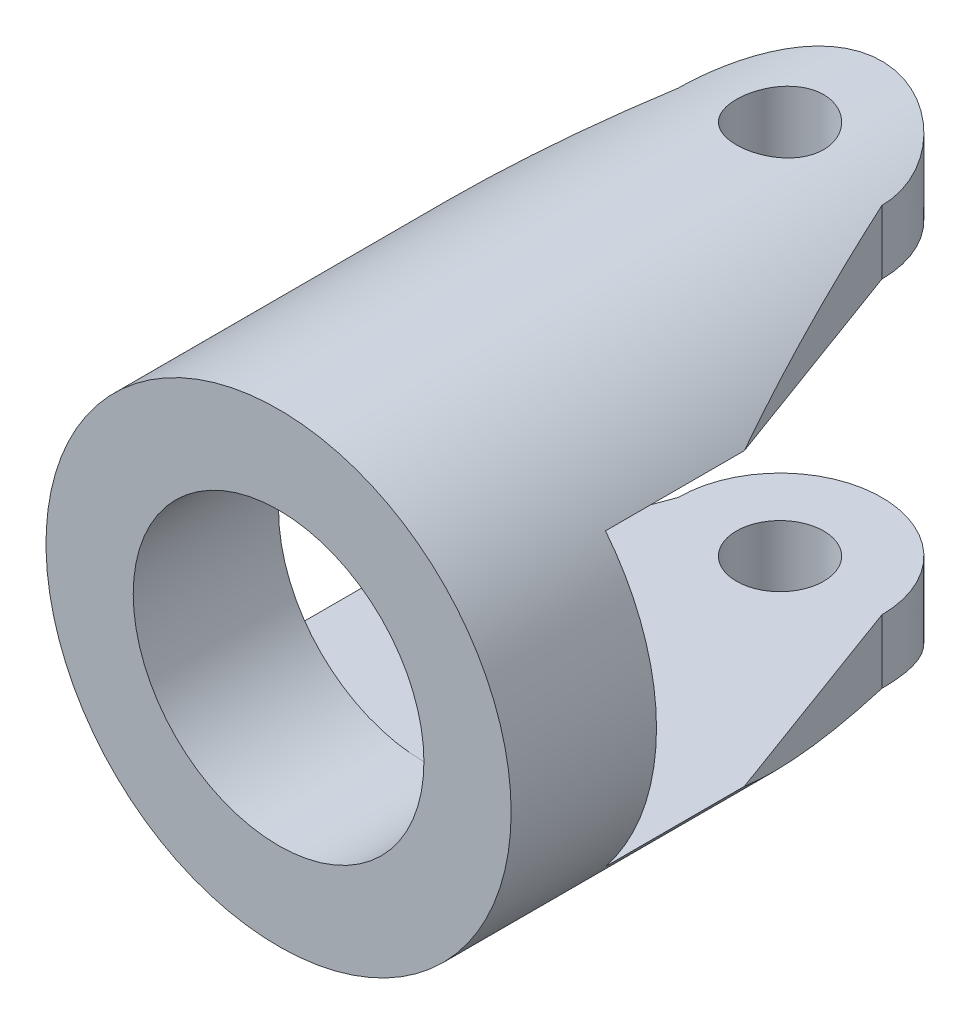
ISO-10303-21;
HEADER;
FILE_DESCRIPTION(('STEP AP214'),'2;1');
FILE_NAME('part.step','',(''),(''),'','','');
FILE_SCHEMA(('AUTOMOTIVE_DESIGN { 1 0 10303 214 1 1 1 1 }'));
ENDSEC;
DATA;
#1=APPLICATION_CONTEXT('core data for automotive mechanical design processes');
#2=APPLICATION_PROTOCOL_DEFINITION('international standard','automotive_design',2000,#1);
#3=PRODUCT_CONTEXT('',#1,'mechanical');
#4=PRODUCT('Part','Part','',(#3));
#5=PRODUCT_RELATED_PRODUCT_CATEGORY('part','',(#4));
#6=PRODUCT_DEFINITION_FORMATION('','',#4);
#7=PRODUCT_DEFINITION_CONTEXT('part definition',#1,'design');
#8=PRODUCT_DEFINITION('design','',#6,#7);
#9=PRODUCT_DEFINITION_SHAPE('','',#8);
#10=(LENGTH_UNIT() NAMED_UNIT(*) SI_UNIT(.MILLI.,.METRE.));
#11=(NAMED_UNIT(*) PLANE_ANGLE_UNIT() SI_UNIT($,.RADIAN.));
#12=(NAMED_UNIT(*) SI_UNIT($,.STERADIAN.) SOLID_ANGLE_UNIT());
#13=UNCERTAINTY_MEASURE_WITH_UNIT(LENGTH_MEASURE(1.E-05),#10,'distance_accuracy_value','');
#14=(GEOMETRIC_REPRESENTATION_CONTEXT(3) GLOBAL_UNCERTAINTY_ASSIGNED_CONTEXT((#13)) GLOBAL_UNIT_ASSIGNED_CONTEXT((#10,
#11,#12)) REPRESENTATION_CONTEXT('',''));
#15=CARTESIAN_POINT('',(0.,0.,0.));
#16=DIRECTION('',(0.,0.,1.));
#17=DIRECTION('',(1.,0.,0.));
#18=AXIS2_PLACEMENT_3D('',#15,#16,#17);
#19=CARTESIAN_POINT('',(-8.,-8.,15.75));
#20=DIRECTION('',(0.938669759516728,0.,0.344817462679614));
#21=DIRECTION('',(0.344817462679614,0.,-0.938669759516728));
#22=AXIS2_PLACEMENT_3D('',#19,#20,#21);
#23=PLANE('',#22);
#24=CARTESIAN_POINT('',(0.,0.,-6.02777777777778));
#25=DIRECTION('',(0.938669759516728,0.,0.344817462679614));
#26=DIRECTION('',(0.344817462679614,0.,-0.938669759516728));
#27=AXIS2_PLACEMENT_3D('',#24,#25,#26);
#28=ELLIPSE('',#27,23.2006811309123,8.);
#29=CARTESIAN_POINT('',(-6.24499799839839,-5.,10.9724945511956));
#30=VERTEX_POINT('',#29);
#31=CARTESIAN_POINT('',(-3.5,-7.19374728496908,3.5));
#32=VERTEX_POINT('',#31);
#33=EDGE_CURVE('E198',#30,#32,#28,.T.);
#34=ORIENTED_EDGE('',*,*,#33,.F.);
#35=DIRECTION('',(0.344817462679614,0.,-0.938669759516728));
#36=VECTOR('',#35,1.);
#37=CARTESIAN_POINT('',(-8.,-5.,15.75));
#38=LINE('',#37,#36);
#39=CARTESIAN_POINT('',(-3.5,-5.,3.5));
#40=VERTEX_POINT('',#39);
#41=EDGE_CURVE('E136',#30,#40,#38,.T.);
#42=ORIENTED_EDGE('',*,*,#41,.T.);
#43=DIRECTION('',(0.,1.,0.));
#44=VECTOR('',#43,1.);
#45=CARTESIAN_POINT('',(-3.5,-8.,3.5));
#46=LINE('',#45,#44);
#47=EDGE_CURVE('E190',#32,#40,#46,.T.);
#48=ORIENTED_EDGE('',*,*,#47,.F.);
#49=EDGE_LOOP('',(#34,#42,#48));
#50=FACE_BOUND('',#49,.T.);
#51=ADVANCED_FACE('F45',(#50),#23,.F.);
#52=CARTESIAN_POINT('',(3.5,-8.,3.5));
#53=DIRECTION('',(-0.938669759516728,0.,0.344817462679614));
#54=DIRECTION('',(0.344817462679614,0.,0.938669759516728));
#55=AXIS2_PLACEMENT_3D('',#52,#53,#54);
#56=PLANE('',#55);
#57=DIRECTION('',(0.,1.,0.));
#58=VECTOR('',#57,1.);
#59=CARTESIAN_POINT('',(3.5,-8.,3.5));
#60=LINE('',#59,#58);
#61=CARTESIAN_POINT('',(3.5,-7.19374728496908,3.5));
#62=VERTEX_POINT('',#61);
#63=CARTESIAN_POINT('',(3.5,-5.,3.5));
#64=VERTEX_POINT('',#63);
#65=EDGE_CURVE('E191',#62,#64,#60,.T.);
#66=ORIENTED_EDGE('',*,*,#65,.T.);
#67=DIRECTION('',(0.344817462679614,0.,0.938669759516728));
#68=VECTOR('',#67,1.);
#69=CARTESIAN_POINT('',(3.5,-5.,3.5));
#70=LINE('',#69,#68);
#71=CARTESIAN_POINT('',(6.2449979983984,-5.,10.9724945511956));
#72=VERTEX_POINT('',#71);
#73=EDGE_CURVE('E138',#64,#72,#70,.T.);
#74=ORIENTED_EDGE('',*,*,#73,.T.);
#75=CARTESIAN_POINT('',(0.,0.,-6.02777777777778));
#76=DIRECTION('',(-0.938669759516728,0.,0.344817462679614));
#77=DIRECTION('',(-0.344817462679614,0.,-0.938669759516728));
#78=AXIS2_PLACEMENT_3D('',#75,#76,#77);
#79=ELLIPSE('',#78,23.2006811309123,8.);
#80=EDGE_CURVE('E195',#62,#72,#79,.T.);
#81=ORIENTED_EDGE('',*,*,#80,.F.);
#82=EDGE_LOOP('',(#66,#74,#81));
#83=FACE_BOUND('',#82,.T.);
#84=ADVANCED_FACE('F233',(#83),#56,.F.);
#85=CARTESIAN_POINT('',(0.,0.,20.75));
#86=DIRECTION('',(0.,0.,1.));
#87=DIRECTION('',(1.,0.,0.));
#88=AXIS2_PLACEMENT_3D('',#85,#86,#87);
#89=PLANE('',#88);
#90=CARTESIAN_POINT('',(0.,0.,20.75));
#91=DIRECTION('',(0.,0.,1.));
#92=DIRECTION('',(1.,0.,0.));
#93=AXIS2_PLACEMENT_3D('',#90,#91,#92);
#94=CIRCLE('',#93,8.);
#95=CARTESIAN_POINT('',(8.,0.,20.75));
#96=VERTEX_POINT('',#95);
#97=EDGE_CURVE('E289',#96,#96,#94,.T.);
#98=ORIENTED_EDGE('',*,*,#97,.T.);
#99=EDGE_LOOP('',(#98));
#100=FACE_BOUND('',#99,.T.);
#101=CARTESIAN_POINT('',(0.,0.,20.75));
#102=DIRECTION('',(0.,0.,1.));
#103=DIRECTION('',(1.,0.,0.));
#104=AXIS2_PLACEMENT_3D('',#101,#102,#103);
#105=CIRCLE('',#104,5.);
#106=CARTESIAN_POINT('',(5.,0.,20.75));
#107=VERTEX_POINT('',#106);
#108=EDGE_CURVE('E285',#107,#107,#105,.T.);
#109=ORIENTED_EDGE('',*,*,#108,.F.);
#110=EDGE_LOOP('',(#109));
#111=FACE_BOUND('',#110,.T.);
#112=ADVANCED_FACE('F231',(#100,#111),#89,.T.);
#113=CARTESIAN_POINT('',(0.,0.,20.75));
#114=DIRECTION('',(0.,0.,-1.));
#115=DIRECTION('',(-1.,0.,0.));
#116=AXIS2_PLACEMENT_3D('',#113,#114,#115);
#117=CYLINDRICAL_SURFACE('',#116,8.);
#118=CARTESIAN_POINT('',(0.,-8.,5.));
#119=CARTESIAN_POINT('',(0.0834717464654708,-7.99999848833852,4.99999681041172));
#120=CARTESIAN_POINT('',(0.166984992730098,-7.99868009921714,4.99300892338062));
#121=CARTESIAN_POINT('',(0.331658129841797,-7.9935478589052,4.96526000488165));
#122=CARTESIAN_POINT('',(0.412815974152225,-7.98973190166897,4.94448734936027));
#123=CARTESIAN_POINT('',(0.570372961851801,-7.98003138765458,4.88982729874066));
#124=CARTESIAN_POINT('',(0.646776330685343,-7.97414869946483,4.85595174754746));
#125=CARTESIAN_POINT('',(0.792807973094006,-7.96095710599783,4.77608112307718));
#126=CARTESIAN_POINT('',(0.862436794477323,-7.9536483161829,4.73008703085518));
#127=CARTESIAN_POINT('',(0.993783715930503,-7.93831336430504,4.62670023199632));
#128=CARTESIAN_POINT('',(1.05540895503183,-7.93028034856351,4.56919055532986));
#129=CARTESIAN_POINT('',(1.16819606135369,-7.9144531845865,4.44465669091244));
#130=CARTESIAN_POINT('',(1.21935717689242,-7.90665905354527,4.37763182023071));
#131=CARTESIAN_POINT('',(1.31014998665793,-7.89212551245005,4.23531391163603));
#132=CARTESIAN_POINT('',(1.34968721969605,-7.88539493886182,4.15995962968276));
#133=CARTESIAN_POINT('',(1.41550524332283,-7.87384713211987,4.00353108482321));
#134=CARTESIAN_POINT('',(1.44178717713098,-7.86902973396962,3.92245731588878));
#135=CARTESIAN_POINT('',(1.480050535035,-7.8619226957455,3.75788476908559));
#136=CARTESIAN_POINT('',(1.49219390192039,-7.85960445366405,3.67442490279653));
#137=CARTESIAN_POINT('',(1.50233808095346,-7.85767197152761,3.50662261519175));
#138=CARTESIAN_POINT('',(1.50034016135374,-7.8580574889876,3.4222802736977));
#139=CARTESIAN_POINT('',(1.48238979602362,-7.86146292701753,3.25628047473395));
#140=CARTESIAN_POINT('',(1.46662149996045,-7.86444808147334,3.17460228569985));
#141=CARTESIAN_POINT('',(1.42186799396207,-7.87266183284666,3.01507158021739));
#142=CARTESIAN_POINT('',(1.39288222239499,-7.87789052509516,2.9372192264907));
#143=CARTESIAN_POINT('',(1.322336471793,-7.89003855292589,2.78701132099973));
#144=CARTESIAN_POINT('',(1.28070213532456,-7.89696783823366,2.71469152941919));
#145=CARTESIAN_POINT('',(1.18609368930416,-7.91172971602918,2.57799527145977));
#146=CARTESIAN_POINT('',(1.13311842889266,-7.91956240015522,2.5136196122852));
#147=CARTESIAN_POINT('',(1.01633905685298,-7.93540001272164,2.39357504432754));
#148=CARTESIAN_POINT('',(0.952377436860682,-7.94340571024031,2.33805934754826));
#149=CARTESIAN_POINT('',(0.815968037098826,-7.95857386108318,2.23852275932459));
#150=CARTESIAN_POINT('',(0.743520172255769,-7.96573630595245,2.19450198312958));
#151=CARTESIAN_POINT('',(0.592034988874668,-7.97842539677509,2.11918224612998));
#152=CARTESIAN_POINT('',(0.512989564446494,-7.98394999136289,2.0878992208821));
#153=CARTESIAN_POINT('',(0.350639115398697,-7.99272505402719,2.03909790690784));
#154=CARTESIAN_POINT('',(0.267334544277787,-7.99597576367994,2.02157815595464));
#155=CARTESIAN_POINT('',(0.100148652903385,-7.99980360641981,2.00101396898173));
#156=CARTESIAN_POINT('',(0.0162940126341347,-8.00041950912279,1.99775960847027));
#157=CARTESIAN_POINT('',(-0.150761248092185,-7.99901543598228,2.00525547954765));
#158=CARTESIAN_POINT('',(-0.233961900480386,-7.99699558964431,2.01600502306526));
#159=CARTESIAN_POINT('',(-0.396681573218217,-7.99057111500406,2.05102903518337));
#160=CARTESIAN_POINT('',(-0.476224261046063,-7.98618522374031,2.07519728253781));
#161=CARTESIAN_POINT('',(-0.630128631824633,-7.97551842212498,2.13625770677879));
#162=CARTESIAN_POINT('',(-0.704489962595103,-7.96923738311334,2.17315074756578));
#163=CARTESIAN_POINT('',(-0.846816671513214,-7.95538030357666,2.25907812815951));
#164=CARTESIAN_POINT('',(-0.914703277015122,-7.94779086174563,2.30824073853684));
#165=CARTESIAN_POINT('',(-1.04133832326455,-7.93219343489712,2.41713813736236));
#166=CARTESIAN_POINT('',(-1.10008590976087,-7.92418541084687,2.47687391300133));
#167=CARTESIAN_POINT('',(-1.20757295872048,-7.9085247569745,2.60617231891143));
#168=CARTESIAN_POINT('',(-1.25616916218577,-7.90087825860257,2.67585490812539));
#169=CARTESIAN_POINT('',(-1.34096675057787,-7.88692985578532,2.82251762452375));
#170=CARTESIAN_POINT('',(-1.37716859613924,-7.8806279013735,2.89949748037047));
#171=CARTESIAN_POINT('',(-1.43594673512823,-7.87013024209574,3.05820586724254));
#172=CARTESIAN_POINT('',(-1.45858868794786,-7.86592440436878,3.13990937955933));
#173=CARTESIAN_POINT('',(-1.48980679326235,-7.86007203802415,3.3060472225214));
#174=CARTESIAN_POINT('',(-1.49838453270708,-7.8584252206579,3.3904812439704));
#175=CARTESIAN_POINT('',(-1.50117762148355,-7.85789199803857,3.55824833144151));
#176=CARTESIAN_POINT('',(-1.49561895003499,-7.85896215974293,3.641577580957));
#177=CARTESIAN_POINT('',(-1.47079175378803,-7.86364600659998,3.80609142204529));
#178=CARTESIAN_POINT('',(-1.45152331089332,-7.86725967655747,3.88727602642744));
#179=CARTESIAN_POINT('',(-1.39991887583263,-7.8766050802318,4.04507448479548));
#180=CARTESIAN_POINT('',(-1.36760735397252,-7.88233284594965,4.12169659134577));
#181=CARTESIAN_POINT('',(-1.29085868912204,-7.8952638755184,4.26846825424084));
#182=CARTESIAN_POINT('',(-1.24642068948186,-7.90246724360119,4.33861735284478));
#183=CARTESIAN_POINT('',(-1.14589487339535,-7.91767266107745,4.47158368004229));
#184=CARTESIAN_POINT('',(-1.08964259864303,-7.92568505353043,4.5342754125671));
#185=CARTESIAN_POINT('',(-0.967427926742291,-7.94152833918735,4.64940516246452));
#186=CARTESIAN_POINT('',(-0.901463301891616,-7.94935919027328,4.70184082098014));
#187=CARTESIAN_POINT('',(-0.760984945071873,-7.96403975968049,4.79541095262706));
#188=CARTESIAN_POINT('',(-0.686399590640516,-7.97088000990561,4.83643942849064));
#189=CARTESIAN_POINT('',(-0.531290113653833,-7.98271619380687,4.90531763660513));
#190=CARTESIAN_POINT('',(-0.450771651705248,-7.98771385879037,4.93317974704691));
#191=CARTESIAN_POINT('',(-0.308347202825154,-7.99428290707632,4.96927731441867));
#192=CARTESIAN_POINT('',(-0.24727381025187,-7.99641470878206,4.9807786303128));
#193=CARTESIAN_POINT('',(-0.124141247115157,-7.9992737995401,4.99614106211645));
#194=CARTESIAN_POINT('',(-0.0620821016527093,-8.00000112429805,5.00000237225591));
#195=CARTESIAN_POINT('',(0.,-8.,5.));
#196=B_SPLINE_CURVE_WITH_KNOTS('',3,(#118,#119,#120,#121,#122,#123,#124,#125,#126,#127,#128,
#129,#130,#131,#132,#133,#134,#135,#136,#137,#138,#139,#140,#141,#142,#143,#144,#145,#146,#147,
#148,#149,#150,#151,#152,#153,#154,#155,#156,#157,#158,#159,#160,#161,#162,#163,#164,#165,#166,
#167,#168,#169,#170,#171,#172,#173,#174,#175,#176,#177,#178,#179,#180,#181,#182,#183,#184,#185,
#186,#187,#188,#189,#190,#191,#192,#193,#194,#195),.UNSPECIFIED.,.T.,.F.,(4,2,2,2,2,2,2,2,2,2,2,
2,2,2,2,2,2,2,2,2,2,2,2,2,2,2,2,2,2,2,2,2,2,2,2,2,2,2,4),(0.,0.250188200964924,
0.500587642535452,0.750761271230907,1.00091465336891,1.2537511801363,1.50660586283617,
1.76146190504358,2.01629596311948,2.26818151445336,2.52004447587256,2.76859000612765,
3.01714609846787,3.26719262629531,3.51726454049859,3.77127768464077,4.02529337544948,
4.27962588321699,4.53393136673745,4.78448174076097,5.03501980464583,5.28360233907828,
5.53220175338032,5.78351778017708,6.03485728413098,6.28953436987299,6.54420198954945,
6.79762627818559,7.05102196946513,7.30039252231748,7.54976158541507,7.79866496207692,
8.04758592655423,8.3002336996638,8.55293951262255,8.80792048916314,9.06266126931173,
9.24874344524409,9.43482089039541),.UNSPECIFIED.);
#197=CARTESIAN_POINT('',(0.,-8.,5.));
#198=VERTEX_POINT('',#197);
#199=EDGE_CURVE('E282',#198,#198,#196,.T.);
#200=ORIENTED_EDGE('',*,*,#199,.T.);
#201=EDGE_LOOP('',(#200));
#202=FACE_BOUND('',#201,.T.);
#203=CARTESIAN_POINT('',(0.,8.,5.));
#204=CARTESIAN_POINT('',(-0.0834717464654708,7.99999848833852,4.99999681041172));
#205=CARTESIAN_POINT('',(-0.166984992730098,7.99868009921714,4.99300892338062));
#206=CARTESIAN_POINT('',(-0.331658129841797,7.9935478589052,4.96526000488165));
#207=CARTESIAN_POINT('',(-0.412815974152225,7.98973190166897,4.94448734936027));
#208=CARTESIAN_POINT('',(-0.570372961851801,7.98003138765458,4.88982729874066));
#209=CARTESIAN_POINT('',(-0.646776330685343,7.97414869946483,4.85595174754746));
#210=CARTESIAN_POINT('',(-0.792807973094006,7.96095710599783,4.77608112307718));
#211=CARTESIAN_POINT('',(-0.862436794477323,7.9536483161829,4.73008703085518));
#212=CARTESIAN_POINT('',(-0.993783715930503,7.93831336430504,4.62670023199632));
#213=CARTESIAN_POINT('',(-1.05540895503183,7.93028034856351,4.56919055532986));
#214=CARTESIAN_POINT('',(-1.16819606135369,7.9144531845865,4.44465669091244));
#215=CARTESIAN_POINT('',(-1.21935717689242,7.90665905354527,4.37763182023071));
#216=CARTESIAN_POINT('',(-1.31014998665793,7.89212551245005,4.23531391163603));
#217=CARTESIAN_POINT('',(-1.34968721969605,7.88539493886182,4.15995962968276));
#218=CARTESIAN_POINT('',(-1.41550524332283,7.87384713211987,4.00353108482321));
#219=CARTESIAN_POINT('',(-1.44178717713098,7.86902973396962,3.92245731588878));
#220=CARTESIAN_POINT('',(-1.480050535035,7.8619226957455,3.75788476908559));
#221=CARTESIAN_POINT('',(-1.49219390192039,7.85960445366405,3.67442490279653));
#222=CARTESIAN_POINT('',(-1.50233808095346,7.85767197152761,3.50662261519175));
#223=CARTESIAN_POINT('',(-1.50034016135374,7.8580574889876,3.4222802736977));
#224=CARTESIAN_POINT('',(-1.48238979602362,7.86146292701753,3.25628047473395));
#225=CARTESIAN_POINT('',(-1.46662149996045,7.86444808147334,3.17460228569985));
#226=CARTESIAN_POINT('',(-1.42186799396207,7.87266183284666,3.01507158021739));
#227=CARTESIAN_POINT('',(-1.39288222239499,7.87789052509516,2.9372192264907));
#228=CARTESIAN_POINT('',(-1.322336471793,7.89003855292589,2.78701132099973));
#229=CARTESIAN_POINT('',(-1.28070213532456,7.89696783823366,2.71469152941919));
#230=CARTESIAN_POINT('',(-1.18609368930416,7.91172971602918,2.57799527145977));
#231=CARTESIAN_POINT('',(-1.13311842889266,7.91956240015522,2.5136196122852));
#232=CARTESIAN_POINT('',(-1.01633905685298,7.93540001272164,2.39357504432754));
#233=CARTESIAN_POINT('',(-0.952377436860682,7.94340571024031,2.33805934754826));
#234=CARTESIAN_POINT('',(-0.815968037098826,7.95857386108318,2.23852275932459));
#235=CARTESIAN_POINT('',(-0.743520172255769,7.96573630595245,2.19450198312958));
#236=CARTESIAN_POINT('',(-0.592034988874668,7.97842539677509,2.11918224612998));
#237=CARTESIAN_POINT('',(-0.512989564446494,7.98394999136289,2.0878992208821));
#238=CARTESIAN_POINT('',(-0.350639115398697,7.99272505402719,2.03909790690784));
#239=CARTESIAN_POINT('',(-0.267334544277787,7.99597576367994,2.02157815595464));
#240=CARTESIAN_POINT('',(-0.100148652903385,7.99980360641981,2.00101396898173));
#241=CARTESIAN_POINT('',(-0.0162940126341347,8.00041950912279,1.99775960847027));
#242=CARTESIAN_POINT('',(0.150761248092185,7.99901543598228,2.00525547954765));
#243=CARTESIAN_POINT('',(0.233961900480386,7.99699558964431,2.01600502306526));
#244=CARTESIAN_POINT('',(0.396681573218217,7.99057111500406,2.05102903518337));
#245=CARTESIAN_POINT('',(0.476224261046063,7.98618522374031,2.07519728253781));
#246=CARTESIAN_POINT('',(0.630128631824633,7.97551842212498,2.13625770677879));
#247=CARTESIAN_POINT('',(0.704489962595103,7.96923738311334,2.17315074756578));
#248=CARTESIAN_POINT('',(0.846816671513214,7.95538030357666,2.25907812815951));
#249=CARTESIAN_POINT('',(0.914703277015122,7.94779086174563,2.30824073853684));
#250=CARTESIAN_POINT('',(1.04133832326455,7.93219343489712,2.41713813736236));
#251=CARTESIAN_POINT('',(1.10008590976087,7.92418541084687,2.47687391300133));
#252=CARTESIAN_POINT('',(1.20757295872048,7.9085247569745,2.60617231891143));
#253=CARTESIAN_POINT('',(1.25616916218577,7.90087825860257,2.67585490812539));
#254=CARTESIAN_POINT('',(1.34096675057787,7.88692985578532,2.82251762452375));
#255=CARTESIAN_POINT('',(1.37716859613924,7.8806279013735,2.89949748037047));
#256=CARTESIAN_POINT('',(1.43594673512823,7.87013024209574,3.05820586724254));
#257=CARTESIAN_POINT('',(1.45858868794786,7.86592440436878,3.13990937955933));
#258=CARTESIAN_POINT('',(1.48980679326235,7.86007203802415,3.3060472225214));
#259=CARTESIAN_POINT('',(1.49838453270708,7.8584252206579,3.3904812439704));
#260=CARTESIAN_POINT('',(1.50117762148355,7.85789199803857,3.55824833144151));
#261=CARTESIAN_POINT('',(1.49561895003499,7.85896215974293,3.641577580957));
#262=CARTESIAN_POINT('',(1.47079175378803,7.86364600659998,3.80609142204529));
#263=CARTESIAN_POINT('',(1.45152331089332,7.86725967655747,3.88727602642744));
#264=CARTESIAN_POINT('',(1.39991887583263,7.8766050802318,4.04507448479548));
#265=CARTESIAN_POINT('',(1.36760735397252,7.88233284594965,4.12169659134577));
#266=CARTESIAN_POINT('',(1.29085868912204,7.8952638755184,4.26846825424084));
#267=CARTESIAN_POINT('',(1.24642068948186,7.90246724360119,4.33861735284478));
#268=CARTESIAN_POINT('',(1.14589487339535,7.91767266107745,4.47158368004229));
#269=CARTESIAN_POINT('',(1.08964259864303,7.92568505353043,4.5342754125671));
#270=CARTESIAN_POINT('',(0.967427926742291,7.94152833918735,4.64940516246452));
#271=CARTESIAN_POINT('',(0.901463301891616,7.94935919027328,4.70184082098014));
#272=CARTESIAN_POINT('',(0.760984945071873,7.96403975968049,4.79541095262706));
#273=CARTESIAN_POINT('',(0.686399590640516,7.97088000990561,4.83643942849064));
#274=CARTESIAN_POINT('',(0.531290113653833,7.98271619380687,4.90531763660513));
#275=CARTESIAN_POINT('',(0.450771651705248,7.98771385879037,4.93317974704691));
#276=CARTESIAN_POINT('',(0.308347202825154,7.99428290707632,4.96927731441867));
#277=CARTESIAN_POINT('',(0.24727381025187,7.99641470878206,4.9807786303128));
#278=CARTESIAN_POINT('',(0.124141247115157,7.9992737995401,4.99614106211645));
#279=CARTESIAN_POINT('',(0.0620821016527093,8.00000112429805,5.00000237225591));
#280=CARTESIAN_POINT('',(0.,8.,5.));
#281=B_SPLINE_CURVE_WITH_KNOTS('',3,(#203,#204,#205,#206,#207,#208,#209,#210,#211,#212,#213,
#214,#215,#216,#217,#218,#219,#220,#221,#222,#223,#224,#225,#226,#227,#228,#229,#230,#231,#232,
#233,#234,#235,#236,#237,#238,#239,#240,#241,#242,#243,#244,#245,#246,#247,#248,#249,#250,#251,
#252,#253,#254,#255,#256,#257,#258,#259,#260,#261,#262,#263,#264,#265,#266,#267,#268,#269,#270,
#271,#272,#273,#274,#275,#276,#277,#278,#279,#280),.UNSPECIFIED.,.T.,.F.,(4,2,2,2,2,2,2,2,2,2,2,
2,2,2,2,2,2,2,2,2,2,2,2,2,2,2,2,2,2,2,2,2,2,2,2,2,2,2,4),(0.,0.250188200964924,
0.500587642535452,0.750761271230907,1.00091465336891,1.2537511801363,1.50660586283617,
1.76146190504358,2.01629596311948,2.26818151445336,2.52004447587256,2.76859000612765,
3.01714609846787,3.26719262629531,3.51726454049859,3.77127768464077,4.02529337544948,
4.27962588321699,4.53393136673745,4.78448174076097,5.03501980464583,5.28360233907828,
5.53220175338032,5.78351778017708,6.03485728413098,6.28953436987299,6.54420198954945,
6.79762627818559,7.05102196946513,7.30039252231748,7.54976158541507,7.79866496207692,
8.04758592655423,8.3002336996638,8.55293951262255,8.80792048916314,9.06266126931173,
9.24874344524409,9.43482089039541),.UNSPECIFIED.);
#282=CARTESIAN_POINT('',(0.,8.,5.));
#283=VERTEX_POINT('',#282);
#284=EDGE_CURVE('E279',#283,#283,#281,.T.);
#285=ORIENTED_EDGE('',*,*,#284,.T.);
#286=EDGE_LOOP('',(#285));
#287=FACE_BOUND('',#286,.T.);
#288=ORIENTED_EDGE('',*,*,#80,.T.);
#289=DIRECTION('',(0.,0.,-1.));
#290=VECTOR('',#289,1.);
#291=CARTESIAN_POINT('',(6.2449979983984,-5.,20.75));
#292=LINE('',#291,#290);
#293=CARTESIAN_POINT('',(6.2449979983984,-5.,15.75));
#294=VERTEX_POINT('',#293);
#295=EDGE_CURVE('E160',#72,#294,#292,.F.);
#296=ORIENTED_EDGE('',*,*,#295,.T.);
#297=CARTESIAN_POINT('',(0.,0.,15.75));
#298=DIRECTION('',(0.,0.,1.));
#299=DIRECTION('',(1.,0.,0.));
#300=AXIS2_PLACEMENT_3D('',#297,#298,#299);
#301=CIRCLE('',#300,8.);
#302=CARTESIAN_POINT('',(6.2449979983984,5.,15.75));
#303=VERTEX_POINT('',#302);
#304=EDGE_CURVE('E132',#294,#303,#301,.T.);
#305=ORIENTED_EDGE('',*,*,#304,.T.);
#306=DIRECTION('',(0.,0.,-1.));
#307=VECTOR('',#306,1.);
#308=CARTESIAN_POINT('',(6.2449979983984,5.,20.75));
#309=LINE('',#308,#307);
#310=CARTESIAN_POINT('',(6.2449979983984,5.,10.9724945511956));
#311=VERTEX_POINT('',#310);
#312=EDGE_CURVE('E171',#303,#311,#309,.T.);
#313=ORIENTED_EDGE('',*,*,#312,.T.);
#314=CARTESIAN_POINT('',(3.5,7.19374728496908,3.5));
#315=VERTEX_POINT('',#314);
#316=EDGE_CURVE('E199',#311,#315,#79,.T.);
#317=ORIENTED_EDGE('',*,*,#316,.T.);
#318=CARTESIAN_POINT('',(3.5,7.19374728496908,3.5));
#319=CARTESIAN_POINT('',(3.50001485206853,7.19372533146612,3.40670420580696));
#320=CARTESIAN_POINT('',(3.49627011403838,7.19556167145534,3.31342041665146));
#321=CARTESIAN_POINT('',(3.4813778037295,7.20278647978779,3.12762559376917));
#322=CARTESIAN_POINT('',(3.47023361861616,7.2081733228471,3.03511422607017));
#323=CARTESIAN_POINT('',(3.44072593894091,7.22230269625902,2.85194456662969));
#324=CARTESIAN_POINT('',(3.42239556757929,7.23102982595696,2.76127975244791));
#325=CARTESIAN_POINT('',(3.37873357473106,7.25153356596949,2.58202401970052));
#326=CARTESIAN_POINT('',(3.35340140351197,7.26331041572224,2.49343326456822));
#327=CARTESIAN_POINT('',(3.26734176383245,7.30263567999198,2.23190798873651));
#328=CARTESIAN_POINT('',(3.19648107164191,7.33421456031173,2.06279285413846));
#329=CARTESIAN_POINT('',(3.03006841049196,7.40451270672814,1.73875724390355));
#330=CARTESIAN_POINT('',(2.93448774812658,7.44324025549963,1.58385354899181));
#331=CARTESIAN_POINT('',(2.71440937532325,7.52639594919093,1.28213105568821));
#332=CARTESIAN_POINT('',(2.58848970771054,7.57102847736001,1.13640340539939));
#333=CARTESIAN_POINT('',(2.31431003940381,7.65928848040779,0.867342532929048));
#334=CARTESIAN_POINT('',(2.16604499251461,7.70291572569405,0.744014383072309));
#335=CARTESIAN_POINT('',(1.84249399250503,7.78681229539758,0.517370737830943));
#336=CARTESIAN_POINT('',(1.6662427135377,7.82681398504641,0.415325022275212));
#337=CARTESIAN_POINT('',(1.29700584553958,7.89639046167058,0.242817361198645));
#338=CARTESIAN_POINT('',(1.10402850607225,7.92597035279101,0.172339950289127));
#339=CARTESIAN_POINT('',(0.718417848710165,7.96990387315612,0.0690488762340595));
#340=CARTESIAN_POINT('',(0.526385095099387,7.98502555309897,0.0343267112230362));
#341=CARTESIAN_POINT('',(0.138661077749574,8.00114702328178,-0.00266321450542897));
#342=CARTESIAN_POINT('',(-0.057028568001586,8.00215291752995,-0.00494500323421339));
#343=CARTESIAN_POINT('',(-0.432525160170883,7.99036087700507,0.0220729438131049));
#344=CARTESIAN_POINT('',(-0.612518096250999,7.97848288699446,0.04926786721238));
#345=CARTESIAN_POINT('',(-0.965080792229635,7.9435515857416,0.13082144800335));
#346=CARTESIAN_POINT('',(-1.13765013801678,7.92049765194766,0.185181618630011));
#347=CARTESIAN_POINT('',(-1.47366940605364,7.86497091241045,0.320126836619429));
#348=CARTESIAN_POINT('',(-1.63693955889595,7.83235948814255,0.401100135807945));
#349=CARTESIAN_POINT('',(-1.94800600887362,7.76084946036412,0.586565433996475));
#350=CARTESIAN_POINT('',(-2.09579645304071,7.72194849278029,0.691066282201005));
#351=CARTESIAN_POINT('',(-2.38373560786356,7.6381919735817,0.929902176460143));
#352=CARTESIAN_POINT('',(-2.52243490670809,7.59310855448435,1.065907933548));
#353=CARTESIAN_POINT('',(-2.77573159770135,7.50422338634216,1.35922247751527));
#354=CARTESIAN_POINT('',(-2.89031491985516,7.46042239826394,1.51654361294616));
#355=CARTESIAN_POINT('',(-3.09648762470001,7.37730715823306,1.8560265798419));
#356=CARTESIAN_POINT('',(-3.18697793378139,7.33824145938744,2.03892879138062));
#357=CARTESIAN_POINT('',(-3.29811031036719,7.28862796819234,2.32403187275786));
#358=CARTESIAN_POINT('',(-3.33104724793822,7.27359105659394,2.42082484729098));
#359=CARTESIAN_POINT('',(-3.38842152900815,7.24704045041328,2.61735473083433));
#360=CARTESIAN_POINT('',(-3.41286264579797,7.23552519201557,2.71709031152281));
#361=CARTESIAN_POINT('',(-3.45512272264285,7.21545369228037,2.92980159993506));
#362=CARTESIAN_POINT('',(-3.47191715953272,7.20736243692402,3.04302666837296));
#363=CARTESIAN_POINT('',(-3.49437331754398,7.19648416669677,3.2708268506689));
#364=CARTESIAN_POINT('',(-3.5000346708629,7.19369732706736,3.38540200900393));
#365=CARTESIAN_POINT('',(-3.5,7.19374728496908,3.5));
#366=B_SPLINE_CURVE_WITH_KNOTS('',3,(#318,#319,#320,#321,#322,#323,#324,#325,#326,#327,#328,
#329,#330,#331,#332,#333,#334,#335,#336,#337,#338,#339,#340,#341,#342,#343,#344,#345,#346,#347,
#348,#349,#350,#351,#352,#353,#354,#355,#356,#357,#358,#359,#360,#361,#362,#363,#364,#365),
.UNSPECIFIED.,.F.,.F.,(4,2,2,2,2,2,2,2,2,2,2,2,2,2,2,2,2,2,2,2,2,2,2,4),(0.,0.279774322021013,
0.559420662969298,0.837792908254939,1.11618701559881,1.6716872826709,2.22783525662958,
2.81835086974068,3.40900003773282,4.02846300088566,4.64762215482545,5.23168448952625,
5.81549425371702,6.3602056907611,6.90494747423582,7.45801796047046,8.01129681666526,
8.60689990643054,9.20284953174921,9.82256266694277,10.1322191682958,10.4417379641238,
10.78531281421,11.1288990147503),.UNSPECIFIED.);
#367=CARTESIAN_POINT('',(-3.5,7.19374728496908,3.5));
#368=VERTEX_POINT('',#367);
#369=EDGE_CURVE('E203',#315,#368,#366,.T.);
#370=ORIENTED_EDGE('',*,*,#369,.T.);
#371=CARTESIAN_POINT('',(-6.24499799839839,5.,10.9724945511956));
#372=VERTEX_POINT('',#371);
#373=EDGE_CURVE('E200',#368,#372,#28,.T.);
#374=ORIENTED_EDGE('',*,*,#373,.T.);
#375=DIRECTION('',(0.,0.,-1.));
#376=VECTOR('',#375,1.);
#377=CARTESIAN_POINT('',(-6.2449979983984,5.,20.75));
#378=LINE('',#377,#376);
#379=CARTESIAN_POINT('',(-6.2449979983984,5.,15.75));
#380=VERTEX_POINT('',#379);
#381=EDGE_CURVE('E126',#372,#380,#378,.F.);
#382=ORIENTED_EDGE('',*,*,#381,.T.);
#383=CARTESIAN_POINT('',(-6.2449979983984,-5.,15.75));
#384=VERTEX_POINT('',#383);
#385=EDGE_CURVE('E120',#380,#384,#301,.T.);
#386=ORIENTED_EDGE('',*,*,#385,.T.);
#387=DIRECTION('',(0.,0.,-1.));
#388=VECTOR('',#387,1.);
#389=CARTESIAN_POINT('',(-6.2449979983984,-5.,20.75));
#390=LINE('',#389,#388);
#391=EDGE_CURVE('E123',#384,#30,#390,.T.);
#392=ORIENTED_EDGE('',*,*,#391,.T.);
#393=ORIENTED_EDGE('',*,*,#33,.T.);
#394=CARTESIAN_POINT('',(-3.5,-7.19374728496908,3.5));
#395=CARTESIAN_POINT('',(-3.50001485206853,-7.19372533146612,3.40670420580696));
#396=CARTESIAN_POINT('',(-3.49627011403838,-7.19556167145534,3.31342041665146));
#397=CARTESIAN_POINT('',(-3.4813778037295,-7.20278647978779,3.12762559376916));
#398=CARTESIAN_POINT('',(-3.47023361861616,-7.2081733228471,3.03511422607017));
#399=CARTESIAN_POINT('',(-3.44072593894091,-7.22230269625902,2.85194456662969));
#400=CARTESIAN_POINT('',(-3.42239556757929,-7.23102982595696,2.76127975244791));
#401=CARTESIAN_POINT('',(-3.37873357473106,-7.25153356596949,2.58202401970052));
#402=CARTESIAN_POINT('',(-3.35340140351196,-7.26331041572224,2.49343326456822));
#403=CARTESIAN_POINT('',(-3.26734176383245,-7.30263567999198,2.23190798873651));
#404=CARTESIAN_POINT('',(-3.19648107164191,-7.33421456031173,2.06279285413846));
#405=CARTESIAN_POINT('',(-3.03006841049196,-7.40451270672814,1.73875724390355));
#406=CARTESIAN_POINT('',(-2.93448774812657,-7.44324025549963,1.58385354899181));
#407=CARTESIAN_POINT('',(-2.71440937532325,-7.52639594919093,1.2821310556882));
#408=CARTESIAN_POINT('',(-2.58848970771054,-7.57102847736001,1.13640340539939));
#409=CARTESIAN_POINT('',(-2.31431003940381,-7.6592884804078,0.867342532929048));
#410=CARTESIAN_POINT('',(-2.16604499251461,-7.70291572569405,0.744014383072308));
#411=CARTESIAN_POINT('',(-1.84249399250503,-7.78681229539758,0.517370737830942));
#412=CARTESIAN_POINT('',(-1.6662427135377,-7.82681398504641,0.415325022275212));
#413=CARTESIAN_POINT('',(-1.29700584553957,-7.89639046167058,0.242817361198644));
#414=CARTESIAN_POINT('',(-1.10402850607224,-7.92597035279101,0.172339950289126));
#415=CARTESIAN_POINT('',(-0.718417848710163,-7.96990387315612,0.0690488762340597));
#416=CARTESIAN_POINT('',(-0.526385095099385,-7.98502555309897,0.034326711223037));
#417=CARTESIAN_POINT('',(-0.138661077749573,-8.00114702328179,-0.00266321450542836));
#418=CARTESIAN_POINT('',(0.0570285680015873,-8.00215291752995,-0.00494500323421355));
#419=CARTESIAN_POINT('',(0.432525160170885,-7.99036087700506,0.0220729438131046));
#420=CARTESIAN_POINT('',(0.612518096251,-7.97848288699446,0.0492678672123801));
#421=CARTESIAN_POINT('',(0.965080792229636,-7.9435515857416,0.13082144800335));
#422=CARTESIAN_POINT('',(1.13765013801678,-7.92049765194766,0.185181618630011));
#423=CARTESIAN_POINT('',(1.47366940605364,-7.86497091241045,0.320126836619429));
#424=CARTESIAN_POINT('',(1.63693955889596,-7.83235948814255,0.401100135807946));
#425=CARTESIAN_POINT('',(1.94800600887362,-7.76084946036412,0.586565433996475));
#426=CARTESIAN_POINT('',(2.09579645304071,-7.72194849278029,0.691066282201005));
#427=CARTESIAN_POINT('',(2.38373560786356,-7.6381919735817,0.929902176460143));
#428=CARTESIAN_POINT('',(2.52243490670809,-7.59310855448435,1.065907933548));
#429=CARTESIAN_POINT('',(2.77573159770135,-7.50422338634216,1.35922247751527));
#430=CARTESIAN_POINT('',(2.89031491985516,-7.46042239826394,1.51654361294616));
#431=CARTESIAN_POINT('',(3.09648762470001,-7.37730715823306,1.8560265798419));
#432=CARTESIAN_POINT('',(3.18697793378139,-7.33824145938743,2.03892879138062));
#433=CARTESIAN_POINT('',(3.29811031036719,-7.28862796819234,2.32403187275786));
#434=CARTESIAN_POINT('',(3.33104724793822,-7.27359105659394,2.42082484729098));
#435=CARTESIAN_POINT('',(3.38842152900815,-7.24704045041328,2.61735473083434));
#436=CARTESIAN_POINT('',(3.41286264579797,-7.23552519201557,2.71709031152281));
#437=CARTESIAN_POINT('',(3.45512272264285,-7.21545369228037,2.92980159993506));
#438=CARTESIAN_POINT('',(3.47191715953272,-7.20736243692402,3.04302666837296));
#439=CARTESIAN_POINT('',(3.49437331754398,-7.19648416669677,3.2708268506689));
#440=CARTESIAN_POINT('',(3.5000346708629,-7.19369732706736,3.38540200900393));
#441=CARTESIAN_POINT('',(3.5,-7.19374728496908,3.5));
#442=B_SPLINE_CURVE_WITH_KNOTS('',3,(#394,#395,#396,#397,#398,#399,#400,#401,#402,#403,#404,
#405,#406,#407,#408,#409,#410,#411,#412,#413,#414,#415,#416,#417,#418,#419,#420,#421,#422,#423,
#424,#425,#426,#427,#428,#429,#430,#431,#432,#433,#434,#435,#436,#437,#438,#439,#440,#441),
.UNSPECIFIED.,.F.,.F.,(4,2,2,2,2,2,2,2,2,2,2,2,2,2,2,2,2,2,2,2,2,2,2,4),(0.,0.279774322021014,
0.559420662969299,0.837792908254938,1.11618701559881,1.6716872826709,2.22783525662958,
2.81835086974068,3.40900003773282,4.02846300088566,4.64762215482545,5.23168448952625,
5.81549425371702,6.3602056907611,6.90494747423582,7.45801796047046,8.01129681666526,
8.60689990643054,9.20284953174921,9.82256266694278,10.1322191682958,10.4417379641238,
10.78531281421,11.1288990147503),.UNSPECIFIED.);
#443=EDGE_CURVE('E212',#32,#62,#442,.T.);
#444=ORIENTED_EDGE('',*,*,#443,.T.);
#445=EDGE_LOOP('',(#288,#296,#305,#313,#317,#370,#374,#382,#386,#392,#393,#444));
#446=FACE_BOUND('',#445,.T.);
#447=ORIENTED_EDGE('',*,*,#97,.F.);
#448=EDGE_LOOP('',(#447));
#449=FACE_BOUND('',#448,.T.);
#450=ADVANCED_FACE('F47',(#202,#287,#446,#449),#117,.T.);
#451=CARTESIAN_POINT('',(0.,0.,20.75));
#452=DIRECTION('',(0.,0.,-1.));
#453=DIRECTION('',(-1.,0.,0.));
#454=AXIS2_PLACEMENT_3D('',#451,#452,#453);
#455=CYLINDRICAL_SURFACE('',#454,5.);
#456=CARTESIAN_POINT('',(0.,0.,15.75));
#457=DIRECTION('',(0.,0.,1.));
#458=DIRECTION('',(1.,0.,0.));
#459=AXIS2_PLACEMENT_3D('',#456,#457,#458);
#460=CIRCLE('',#459,5.);
#461=CARTESIAN_POINT('',(0.,5.,15.75));
#462=VERTEX_POINT('',#461);
#463=CARTESIAN_POINT('',(0.,-5.,15.75));
#464=VERTEX_POINT('',#463);
#465=EDGE_CURVE('E143',#462,#464,#460,.T.);
#466=ORIENTED_EDGE('',*,*,#465,.F.);
#467=EDGE_CURVE('E183',#464,#462,#460,.T.);
#468=ORIENTED_EDGE('',*,*,#467,.F.);
#469=EDGE_LOOP('',(#466,#468));
#470=FACE_BOUND('',#469,.T.);
#471=ORIENTED_EDGE('',*,*,#108,.T.);
#472=EDGE_LOOP('',(#471));
#473=FACE_BOUND('',#472,.T.);
#474=ADVANCED_FACE('F224',(#470,#473),#455,.F.);
#475=CARTESIAN_POINT('',(0.,-8.,3.5));
#476=DIRECTION('',(0.,1.,0.));
#477=DIRECTION('',(0.,0.,1.));
#478=AXIS2_PLACEMENT_3D('',#475,#476,#477);
#479=CYLINDRICAL_SURFACE('',#478,3.5);
#480=CARTESIAN_POINT('',(3.5,5.,3.5));
#481=VERTEX_POINT('',#480);
#482=EDGE_CURVE('E131',#481,#315,#60,.T.);
#483=ORIENTED_EDGE('',*,*,#482,.F.);
#484=CARTESIAN_POINT('',(0.,5.,3.5));
#485=DIRECTION('',(0.,1.,0.));
#486=DIRECTION('',(0.,0.,1.));
#487=AXIS2_PLACEMENT_3D('',#484,#485,#486);
#488=CIRCLE('',#487,3.5);
#489=CARTESIAN_POINT('',(-3.5,5.,3.5));
#490=VERTEX_POINT('',#489);
#491=EDGE_CURVE('E70',#481,#490,#488,.T.);
#492=ORIENTED_EDGE('',*,*,#491,.T.);
#493=EDGE_CURVE('E187',#490,#368,#46,.T.);
#494=ORIENTED_EDGE('',*,*,#493,.T.);
#495=ORIENTED_EDGE('',*,*,#369,.F.);
#496=EDGE_LOOP('',(#483,#492,#494,#495));
#497=FACE_BOUND('',#496,.T.);
#498=ADVANCED_FACE('F218',(#497),#479,.T.);
#499=ORIENTED_EDGE('',*,*,#47,.T.);
#500=CARTESIAN_POINT('',(0.,-5.,3.5));
#501=DIRECTION('',(0.,-1.,0.));
#502=DIRECTION('',(0.,0.,-1.));
#503=AXIS2_PLACEMENT_3D('',#500,#501,#502);
#504=CIRCLE('',#503,3.5);
#505=EDGE_CURVE('E157',#40,#64,#504,.T.);
#506=ORIENTED_EDGE('',*,*,#505,.T.);
#507=ORIENTED_EDGE('',*,*,#65,.F.);
#508=ORIENTED_EDGE('',*,*,#443,.F.);
#509=EDGE_LOOP('',(#499,#506,#507,#508));
#510=FACE_BOUND('',#509,.T.);
#511=ADVANCED_FACE('F223',(#510),#479,.T.);
#512=ORIENTED_EDGE('',*,*,#493,.F.);
#513=DIRECTION('',(-0.344817462679614,0.,0.938669759516728));
#514=VECTOR('',#513,1.);
#515=CARTESIAN_POINT('',(-8.,5.,15.75));
#516=LINE('',#515,#514);
#517=EDGE_CURVE('E168',#490,#372,#516,.T.);
#518=ORIENTED_EDGE('',*,*,#517,.T.);
#519=ORIENTED_EDGE('',*,*,#373,.F.);
#520=EDGE_LOOP('',(#512,#518,#519));
#521=FACE_BOUND('',#520,.T.);
#522=ADVANCED_FACE('F245',(#521),#23,.F.);
#523=ORIENTED_EDGE('',*,*,#316,.F.);
#524=DIRECTION('',(-0.344817462679614,0.,-0.938669759516728));
#525=VECTOR('',#524,1.);
#526=CARTESIAN_POINT('',(3.5,5.,3.5));
#527=LINE('',#526,#525);
#528=EDGE_CURVE('E172',#311,#481,#527,.T.);
#529=ORIENTED_EDGE('',*,*,#528,.T.);
#530=ORIENTED_EDGE('',*,*,#482,.T.);
#531=EDGE_LOOP('',(#523,#529,#530));
#532=FACE_BOUND('',#531,.T.);
#533=ADVANCED_FACE('F226',(#532),#56,.F.);
#534=CARTESIAN_POINT('',(0.,-8.,3.5));
#535=DIRECTION('',(0.,1.,0.));
#536=DIRECTION('',(0.,0.,1.));
#537=AXIS2_PLACEMENT_3D('',#534,#535,#536);
#538=CYLINDRICAL_SURFACE('',#537,1.5);
#539=CARTESIAN_POINT('',(0.,5.,3.5));
#540=DIRECTION('',(0.,1.,0.));
#541=DIRECTION('',(0.,0.,1.));
#542=AXIS2_PLACEMENT_3D('',#539,#540,#541);
#543=CIRCLE('',#542,1.5);
#544=CARTESIAN_POINT('',(0.,5.,5.));
#545=VERTEX_POINT('',#544);
#546=EDGE_CURVE('E11',#545,#545,#543,.F.);
#547=ORIENTED_EDGE('',*,*,#546,.T.);
#548=EDGE_LOOP('',(#547));
#549=FACE_BOUND('',#548,.T.);
#550=ORIENTED_EDGE('',*,*,#284,.F.);
#551=EDGE_LOOP('',(#550));
#552=FACE_BOUND('',#551,.T.);
#553=ADVANCED_FACE('F255',(#549,#552),#538,.F.);
#554=CARTESIAN_POINT('',(0.,-5.,3.5));
#555=DIRECTION('',(0.,-1.,0.));
#556=DIRECTION('',(0.,0.,-1.));
#557=AXIS2_PLACEMENT_3D('',#554,#555,#556);
#558=CIRCLE('',#557,1.5);
#559=CARTESIAN_POINT('',(0.,-5.,2.));
#560=VERTEX_POINT('',#559);
#561=EDGE_CURVE('E55',#560,#560,#558,.F.);
#562=ORIENTED_EDGE('',*,*,#561,.T.);
#563=EDGE_LOOP('',(#562));
#564=FACE_BOUND('',#563,.T.);
#565=ORIENTED_EDGE('',*,*,#199,.F.);
#566=EDGE_LOOP('',(#565));
#567=FACE_BOUND('',#566,.T.);
#568=ADVANCED_FACE('F302',(#564,#567),#538,.F.);
#569=CARTESIAN_POINT('',(-8.,5.,15.75));
#570=DIRECTION('',(0.,0.,1.));
#571=DIRECTION('',(1.,0.,0.));
#572=AXIS2_PLACEMENT_3D('',#569,#570,#571);
#573=PLANE('',#572);
#574=DIRECTION('',(1.,0.,0.));
#575=VECTOR('',#574,1.);
#576=CARTESIAN_POINT('',(-8.,5.,15.75));
#577=LINE('',#576,#575);
#578=EDGE_CURVE('E151',#380,#462,#577,.T.);
#579=ORIENTED_EDGE('',*,*,#578,.T.);
#580=ORIENTED_EDGE('',*,*,#465,.T.);
#581=DIRECTION('',(1.,0.,0.));
#582=VECTOR('',#581,1.);
#583=CARTESIAN_POINT('',(-8.,-5.,15.75));
#584=LINE('',#583,#582);
#585=EDGE_CURVE('E62',#384,#464,#584,.T.);
#586=ORIENTED_EDGE('',*,*,#585,.F.);
#587=ORIENTED_EDGE('',*,*,#385,.F.);
#588=EDGE_LOOP('',(#579,#580,#586,#587));
#589=FACE_BOUND('',#588,.T.);
#590=ADVANCED_FACE('F141',(#589),#573,.F.);
#591=ORIENTED_EDGE('',*,*,#304,.F.);
#592=EDGE_CURVE('E146',#464,#294,#584,.T.);
#593=ORIENTED_EDGE('',*,*,#592,.F.);
#594=ORIENTED_EDGE('',*,*,#467,.T.);
#595=EDGE_CURVE('E153',#462,#303,#577,.T.);
#596=ORIENTED_EDGE('',*,*,#595,.T.);
#597=EDGE_LOOP('',(#591,#593,#594,#596));
#598=FACE_BOUND('',#597,.T.);
#599=ADVANCED_FACE('F268',(#598),#573,.F.);
#600=CARTESIAN_POINT('',(-8.,5.,0.));
#601=DIRECTION('',(0.,1.,0.));
#602=DIRECTION('',(0.,0.,1.));
#603=AXIS2_PLACEMENT_3D('',#600,#601,#602);
#604=PLANE('',#603);
#605=ORIENTED_EDGE('',*,*,#546,.F.);
#606=EDGE_LOOP('',(#605));
#607=FACE_BOUND('',#606,.T.);
#608=ORIENTED_EDGE('',*,*,#595,.F.);
#609=ORIENTED_EDGE('',*,*,#578,.F.);
#610=ORIENTED_EDGE('',*,*,#381,.F.);
#611=ORIENTED_EDGE('',*,*,#517,.F.);
#612=ORIENTED_EDGE('',*,*,#491,.F.);
#613=ORIENTED_EDGE('',*,*,#528,.F.);
#614=ORIENTED_EDGE('',*,*,#312,.F.);
#615=EDGE_LOOP('',(#608,#609,#610,#611,#612,#613,#614));
#616=FACE_BOUND('',#615,.T.);
#617=ADVANCED_FACE('F266',(#607,#616),#604,.F.);
#618=CARTESIAN_POINT('',(-8.,-5.,0.));
#619=DIRECTION('',(0.,-1.,0.));
#620=DIRECTION('',(0.,0.,-1.));
#621=AXIS2_PLACEMENT_3D('',#618,#619,#620);
#622=PLANE('',#621);
#623=ORIENTED_EDGE('',*,*,#561,.F.);
#624=EDGE_LOOP('',(#623));
#625=FACE_BOUND('',#624,.T.);
#626=ORIENTED_EDGE('',*,*,#73,.F.);
#627=ORIENTED_EDGE('',*,*,#505,.F.);
#628=ORIENTED_EDGE('',*,*,#41,.F.);
#629=ORIENTED_EDGE('',*,*,#391,.F.);
#630=ORIENTED_EDGE('',*,*,#585,.T.);
#631=ORIENTED_EDGE('',*,*,#592,.T.);
#632=ORIENTED_EDGE('',*,*,#295,.F.);
#633=EDGE_LOOP('',(#626,#627,#628,#629,#630,#631,#632));
#634=FACE_BOUND('',#633,.T.);
#635=ADVANCED_FACE('F134',(#625,#634),#622,.F.);
#636=CLOSED_SHELL('',(#51,#84,#112,#450,#474,#498,#511,#522,#533,#553,#568,#590,#599,#617,#635));
#637=MANIFOLD_SOLID_BREP('B2',#636);
#638=ADVANCED_BREP_SHAPE_REPRESENTATION('',(#18,#637),#14);
#639=SHAPE_DEFINITION_REPRESENTATION(#9,#638);
ENDSEC;
END-ISO-10303-21;
